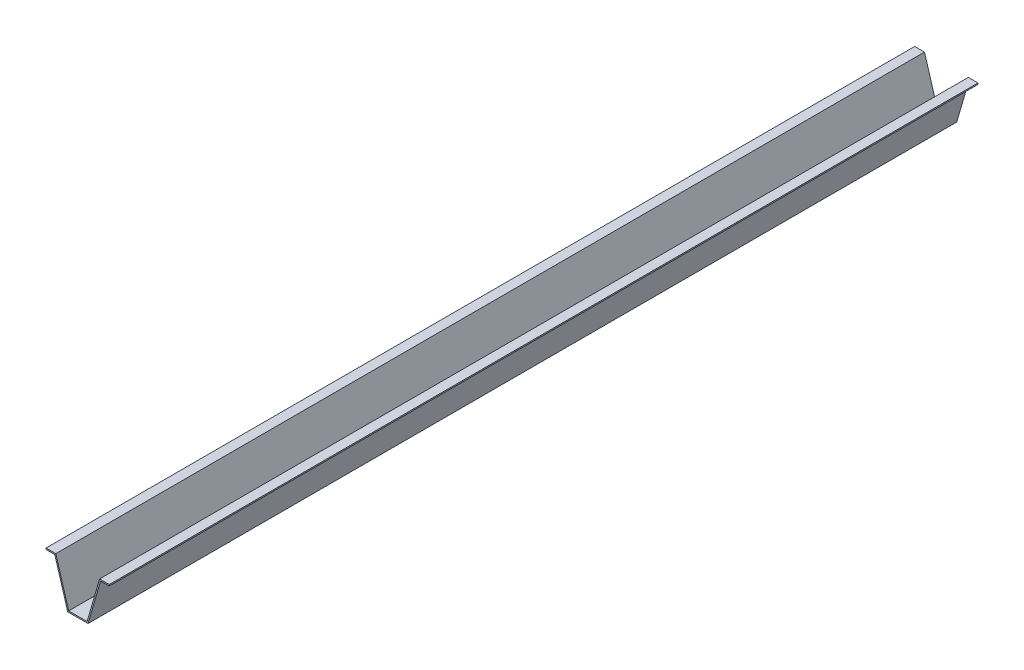
ISO-10303-21;
HEADER;
FILE_DESCRIPTION(('STEP AP214'),'2;1');
FILE_NAME('part.step','',(''),(''),'','','');
FILE_SCHEMA(('AUTOMOTIVE_DESIGN { 1 0 10303 214 1 1 1 1 }'));
ENDSEC;
DATA;
#1=APPLICATION_CONTEXT('core data for automotive mechanical design processes');
#2=APPLICATION_PROTOCOL_DEFINITION('international standard','automotive_design',2000,#1);
#3=PRODUCT_CONTEXT('',#1,'mechanical');
#4=PRODUCT('Part','Part','',(#3));
#5=PRODUCT_RELATED_PRODUCT_CATEGORY('part','',(#4));
#6=PRODUCT_DEFINITION_FORMATION('','',#4);
#7=PRODUCT_DEFINITION_CONTEXT('part definition',#1,'design');
#8=PRODUCT_DEFINITION('design','',#6,#7);
#9=PRODUCT_DEFINITION_SHAPE('','',#8);
#10=(LENGTH_UNIT() NAMED_UNIT(*) SI_UNIT(.MILLI.,.METRE.));
#11=(NAMED_UNIT(*) PLANE_ANGLE_UNIT() SI_UNIT($,.RADIAN.));
#12=(NAMED_UNIT(*) SI_UNIT($,.STERADIAN.) SOLID_ANGLE_UNIT());
#13=UNCERTAINTY_MEASURE_WITH_UNIT(LENGTH_MEASURE(1.E-05),#10,'distance_accuracy_value','');
#14=(GEOMETRIC_REPRESENTATION_CONTEXT(3) GLOBAL_UNCERTAINTY_ASSIGNED_CONTEXT((#13)) GLOBAL_UNIT_ASSIGNED_CONTEXT((#10,
#11,#12)) REPRESENTATION_CONTEXT('',''));
#15=CARTESIAN_POINT('',(0.,0.,0.));
#16=DIRECTION('',(0.,0.,1.));
#17=DIRECTION('',(1.,0.,0.));
#18=AXIS2_PLACEMENT_3D('',#15,#16,#17);
#19=CARTESIAN_POINT('',(53.2298011090364,23.227685088634,2000.));
#20=DIRECTION('',(0.,1.,0.));
#21=DIRECTION('',(0.,0.,1.));
#22=AXIS2_PLACEMENT_3D('',#19,#20,#21);
#23=PLANE('',#22);
#24=DIRECTION('',(1.,0.,0.));
#25=VECTOR('',#24,1.);
#26=CARTESIAN_POINT('',(53.2298011090364,23.227685088634,0.));
#27=LINE('',#26,#25);
#28=CARTESIAN_POINT('',(55.4828650000969,23.227685088634,0.));
#29=VERTEX_POINT('',#28);
#30=CARTESIAN_POINT('',(75.5177051757726,23.227685088634,0.));
#31=VERTEX_POINT('',#30);
#32=EDGE_CURVE('E155',#29,#31,#27,.T.);
#33=ORIENTED_EDGE('',*,*,#32,.T.);
#34=DIRECTION('',(0.,0.,-1.));
#35=VECTOR('',#34,1.);
#36=CARTESIAN_POINT('',(75.5177051757726,23.227685088634,2000.));
#37=LINE('',#36,#35);
#38=CARTESIAN_POINT('',(75.5177051757726,23.227685088634,2000.));
#39=VERTEX_POINT('',#38);
#40=EDGE_CURVE('E11',#39,#31,#37,.T.);
#41=ORIENTED_EDGE('',*,*,#40,.F.);
#42=DIRECTION('',(1.,0.,0.));
#43=VECTOR('',#42,1.);
#44=CARTESIAN_POINT('',(53.2298011090364,23.227685088634,2000.));
#45=LINE('',#44,#43);
#46=CARTESIAN_POINT('',(55.4828650000969,23.227685088634,2000.));
#47=VERTEX_POINT('',#46);
#48=EDGE_CURVE('E103',#47,#39,#45,.T.);
#49=ORIENTED_EDGE('',*,*,#48,.F.);
#50=DIRECTION('',(0.,0.,-1.));
#51=VECTOR('',#50,1.);
#52=CARTESIAN_POINT('',(55.4828650000969,23.227685088634,2000.));
#53=LINE('',#52,#51);
#54=EDGE_CURVE('E151',#47,#29,#53,.T.);
#55=ORIENTED_EDGE('',*,*,#54,.T.);
#56=EDGE_LOOP('',(#33,#41,#49,#55));
#57=FACE_BOUND('',#56,.T.);
#58=ADVANCED_FACE('F35',(#57),#23,.F.);
#59=CARTESIAN_POINT('',(75.5177051757726,26.227685088634,2000.));
#60=DIRECTION('',(1.,0.,0.));
#61=DIRECTION('',(0.,0.,-1.));
#62=AXIS2_PLACEMENT_3D('',#59,#60,#61);
#63=PLANE('',#62);
#64=DIRECTION('',(0.,-1.,0.));
#65=VECTOR('',#64,1.);
#66=CARTESIAN_POINT('',(75.5177051757726,26.227685088634,0.));
#67=LINE('',#66,#65);
#68=CARTESIAN_POINT('',(75.5177051757726,26.227685088634,0.));
#69=VERTEX_POINT('',#68);
#70=EDGE_CURVE('E158',#69,#31,#67,.T.);
#71=ORIENTED_EDGE('',*,*,#70,.F.);
#72=DIRECTION('',(0.,0.,-1.));
#73=VECTOR('',#72,1.);
#74=CARTESIAN_POINT('',(75.5177051757726,26.227685088634,2000.));
#75=LINE('',#74,#73);
#76=CARTESIAN_POINT('',(75.5177051757726,26.227685088634,2000.));
#77=VERTEX_POINT('',#76);
#78=EDGE_CURVE('E43',#77,#69,#75,.T.);
#79=ORIENTED_EDGE('',*,*,#78,.F.);
#80=DIRECTION('',(0.,-1.,0.));
#81=VECTOR('',#80,1.);
#82=CARTESIAN_POINT('',(75.5177051757726,26.227685088634,2000.));
#83=LINE('',#82,#81);
#84=EDGE_CURVE('E220',#77,#39,#83,.T.);
#85=ORIENTED_EDGE('',*,*,#84,.T.);
#86=ORIENTED_EDGE('',*,*,#40,.T.);
#87=EDGE_LOOP('',(#71,#79,#85,#86));
#88=FACE_BOUND('',#87,.T.);
#89=ADVANCED_FACE('F207',(#88),#63,.T.);
#90=CARTESIAN_POINT('',(53.2298011090364,26.227685088634,2000.));
#91=DIRECTION('',(0.,1.,0.));
#92=DIRECTION('',(0.,0.,1.));
#93=AXIS2_PLACEMENT_3D('',#90,#91,#92);
#94=PLANE('',#93);
#95=DIRECTION('',(1.,0.,0.));
#96=VECTOR('',#95,1.);
#97=CARTESIAN_POINT('',(53.2298011090364,26.227685088634,0.));
#98=LINE('',#97,#96);
#99=CARTESIAN_POINT('',(53.2298011090364,26.227685088634,0.));
#100=VERTEX_POINT('',#99);
#101=EDGE_CURVE('E161',#100,#69,#98,.T.);
#102=ORIENTED_EDGE('',*,*,#101,.F.);
#103=DIRECTION('',(0.,0.,-1.));
#104=VECTOR('',#103,1.);
#105=CARTESIAN_POINT('',(53.2298011090364,26.227685088634,2000.));
#106=LINE('',#105,#104);
#107=CARTESIAN_POINT('',(53.2298011090364,26.227685088634,2000.));
#108=VERTEX_POINT('',#107);
#109=EDGE_CURVE('E197',#108,#100,#106,.T.);
#110=ORIENTED_EDGE('',*,*,#109,.F.);
#111=DIRECTION('',(1.,0.,0.));
#112=VECTOR('',#111,1.);
#113=CARTESIAN_POINT('',(53.2298011090364,26.227685088634,2000.));
#114=LINE('',#113,#112);
#115=EDGE_CURVE('E204',#108,#77,#114,.T.);
#116=ORIENTED_EDGE('',*,*,#115,.T.);
#117=ORIENTED_EDGE('',*,*,#78,.T.);
#118=EDGE_LOOP('',(#102,#110,#116,#117));
#119=FACE_BOUND('',#118,.T.);
#120=ADVANCED_FACE('F202',(#119),#94,.T.);
#121=CARTESIAN_POINT('',(24.4131170631553,-73.0547966631908,2000.));
#122=DIRECTION('',(-0.960365033864225,0.278745406654469,0.));
#123=DIRECTION('',(-0.278745406654469,-0.960365033864225,0.));
#124=AXIS2_PLACEMENT_3D('',#121,#122,#123);
#125=PLANE('',#124);
#126=DIRECTION('',(0.278745406654469,0.960365033864225,0.));
#127=VECTOR('',#126,1.);
#128=CARTESIAN_POINT('',(24.4131170631553,-73.0547966631908,0.));
#129=LINE('',#128,#127);
#130=CARTESIAN_POINT('',(24.4131170631553,-73.0547966631908,0.));
#131=VERTEX_POINT('',#130);
#132=EDGE_CURVE('E164',#131,#100,#129,.T.);
#133=ORIENTED_EDGE('',*,*,#132,.F.);
#134=DIRECTION('',(0.,0.,-1.));
#135=VECTOR('',#134,1.);
#136=CARTESIAN_POINT('',(24.4131170631553,-73.0547966631908,2000.));
#137=LINE('',#136,#135);
#138=CARTESIAN_POINT('',(24.4131170631553,-73.0547966631908,2000.));
#139=VERTEX_POINT('',#138);
#140=EDGE_CURVE('E195',#139,#131,#137,.T.);
#141=ORIENTED_EDGE('',*,*,#140,.F.);
#142=DIRECTION('',(0.278745406654469,0.960365033864225,0.));
#143=VECTOR('',#142,1.);
#144=CARTESIAN_POINT('',(24.4131170631553,-73.0547966631908,2000.));
#145=LINE('',#144,#143);
#146=EDGE_CURVE('E217',#139,#108,#145,.T.);
#147=ORIENTED_EDGE('',*,*,#146,.T.);
#148=ORIENTED_EDGE('',*,*,#109,.T.);
#149=EDGE_LOOP('',(#133,#141,#147,#148));
#150=FACE_BOUND('',#149,.T.);
#151=ADVANCED_FACE('F214',(#150),#125,.T.);
#152=CARTESIAN_POINT('',(-17.9113876292326,-73.0547966631908,2000.));
#153=DIRECTION('',(0.,1.,0.));
#154=DIRECTION('',(0.,0.,1.));
#155=AXIS2_PLACEMENT_3D('',#152,#153,#154);
#156=PLANE('',#155);
#157=DIRECTION('',(1.,0.,0.));
#158=VECTOR('',#157,1.);
#159=CARTESIAN_POINT('',(-17.9113876292326,-73.0547966631908,0.));
#160=LINE('',#159,#158);
#161=CARTESIAN_POINT('',(-17.9113876292326,-73.0547966631908,0.));
#162=VERTEX_POINT('',#161);
#163=EDGE_CURVE('E167',#162,#131,#160,.T.);
#164=ORIENTED_EDGE('',*,*,#163,.F.);
#165=DIRECTION('',(0.,0.,-1.));
#166=VECTOR('',#165,1.);
#167=CARTESIAN_POINT('',(-17.9113876292326,-73.0547966631908,2000.));
#168=LINE('',#167,#166);
#169=CARTESIAN_POINT('',(-17.9113876292326,-73.0547966631908,2000.));
#170=VERTEX_POINT('',#169);
#171=EDGE_CURVE('E193',#170,#162,#168,.T.);
#172=ORIENTED_EDGE('',*,*,#171,.F.);
#173=DIRECTION('',(1.,0.,0.));
#174=VECTOR('',#173,1.);
#175=CARTESIAN_POINT('',(-17.9113876292326,-73.0547966631908,2000.));
#176=LINE('',#175,#174);
#177=EDGE_CURVE('E222',#170,#139,#176,.T.);
#178=ORIENTED_EDGE('',*,*,#177,.T.);
#179=ORIENTED_EDGE('',*,*,#140,.T.);
#180=EDGE_LOOP('',(#164,#172,#178,#179));
#181=FACE_BOUND('',#180,.T.);
#182=ADVANCED_FACE('F322',(#181),#156,.T.);
#183=CARTESIAN_POINT('',(-47.6285930515475,26.227685088634,2000.));
#184=DIRECTION('',(0.958005466795834,0.286749935639569,0.));
#185=DIRECTION('',(-0.286749935639569,0.958005466795834,0.));
#186=AXIS2_PLACEMENT_3D('',#183,#184,#185);
#187=PLANE('',#186);
#188=DIRECTION('',(0.286749935639569,-0.958005466795834,0.));
#189=VECTOR('',#188,1.);
#190=CARTESIAN_POINT('',(-47.6285930515475,26.227685088634,0.));
#191=LINE('',#190,#189);
#192=CARTESIAN_POINT('',(-47.6285930515475,26.227685088634,0.));
#193=VERTEX_POINT('',#192);
#194=EDGE_CURVE('E170',#193,#162,#191,.T.);
#195=ORIENTED_EDGE('',*,*,#194,.F.);
#196=DIRECTION('',(0.,0.,-1.));
#197=VECTOR('',#196,1.);
#198=CARTESIAN_POINT('',(-47.6285930515475,26.227685088634,2000.));
#199=LINE('',#198,#197);
#200=CARTESIAN_POINT('',(-47.6285930515475,26.227685088634,2000.));
#201=VERTEX_POINT('',#200);
#202=EDGE_CURVE('E191',#201,#193,#199,.T.);
#203=ORIENTED_EDGE('',*,*,#202,.F.);
#204=DIRECTION('',(0.286749935639569,-0.958005466795834,0.));
#205=VECTOR('',#204,1.);
#206=CARTESIAN_POINT('',(-47.6285930515475,26.227685088634,2000.));
#207=LINE('',#206,#205);
#208=EDGE_CURVE('E228',#201,#170,#207,.T.);
#209=ORIENTED_EDGE('',*,*,#208,.T.);
#210=ORIENTED_EDGE('',*,*,#171,.T.);
#211=EDGE_LOOP('',(#195,#203,#209,#210));
#212=FACE_BOUND('',#211,.T.);
#213=ADVANCED_FACE('F313',(#212),#187,.T.);
#214=CARTESIAN_POINT('',(-70.1416274623922,26.227685088634,2000.));
#215=DIRECTION('',(0.,1.,0.));
#216=DIRECTION('',(0.,0.,1.));
#217=AXIS2_PLACEMENT_3D('',#214,#215,#216);
#218=PLANE('',#217);
#219=DIRECTION('',(1.,0.,0.));
#220=VECTOR('',#219,1.);
#221=CARTESIAN_POINT('',(-70.1416274623922,26.227685088634,0.));
#222=LINE('',#221,#220);
#223=CARTESIAN_POINT('',(-70.1416274623922,26.227685088634,0.));
#224=VERTEX_POINT('',#223);
#225=EDGE_CURVE('E173',#224,#193,#222,.T.);
#226=ORIENTED_EDGE('',*,*,#225,.F.);
#227=DIRECTION('',(0.,0.,-1.));
#228=VECTOR('',#227,1.);
#229=CARTESIAN_POINT('',(-70.1416274623922,26.227685088634,2000.));
#230=LINE('',#229,#228);
#231=CARTESIAN_POINT('',(-70.1416274623922,26.227685088634,2000.));
#232=VERTEX_POINT('',#231);
#233=EDGE_CURVE('E189',#232,#224,#230,.T.);
#234=ORIENTED_EDGE('',*,*,#233,.F.);
#235=DIRECTION('',(1.,0.,0.));
#236=VECTOR('',#235,1.);
#237=CARTESIAN_POINT('',(-70.1416274623922,26.227685088634,2000.));
#238=LINE('',#237,#236);
#239=EDGE_CURVE('E231',#232,#201,#238,.T.);
#240=ORIENTED_EDGE('',*,*,#239,.T.);
#241=ORIENTED_EDGE('',*,*,#202,.T.);
#242=EDGE_LOOP('',(#226,#234,#240,#241));
#243=FACE_BOUND('',#242,.T.);
#244=ADVANCED_FACE('F243',(#243),#218,.T.);
#245=CARTESIAN_POINT('',(-70.1416274623922,23.227685088634,2000.));
#246=DIRECTION('',(-1.,0.,0.));
#247=DIRECTION('',(0.,0.,1.));
#248=AXIS2_PLACEMENT_3D('',#245,#246,#247);
#249=PLANE('',#248);
#250=DIRECTION('',(0.,1.,0.));
#251=VECTOR('',#250,1.);
#252=CARTESIAN_POINT('',(-70.1416274623922,23.227685088634,0.));
#253=LINE('',#252,#251);
#254=CARTESIAN_POINT('',(-70.1416274623922,23.227685088634,0.));
#255=VERTEX_POINT('',#254);
#256=EDGE_CURVE('E176',#255,#224,#253,.T.);
#257=ORIENTED_EDGE('',*,*,#256,.F.);
#258=DIRECTION('',(0.,0.,-1.));
#259=VECTOR('',#258,1.);
#260=CARTESIAN_POINT('',(-70.1416274623922,23.227685088634,2000.));
#261=LINE('',#260,#259);
#262=CARTESIAN_POINT('',(-70.1416274623922,23.227685088634,2000.));
#263=VERTEX_POINT('',#262);
#264=EDGE_CURVE('E187',#263,#255,#261,.T.);
#265=ORIENTED_EDGE('',*,*,#264,.F.);
#266=DIRECTION('',(0.,1.,0.));
#267=VECTOR('',#266,1.);
#268=CARTESIAN_POINT('',(-70.1416274623922,23.227685088634,2000.));
#269=LINE('',#268,#267);
#270=EDGE_CURVE('E234',#263,#232,#269,.T.);
#271=ORIENTED_EDGE('',*,*,#270,.T.);
#272=ORIENTED_EDGE('',*,*,#233,.T.);
#273=EDGE_LOOP('',(#257,#265,#271,#272));
#274=FACE_BOUND('',#273,.T.);
#275=ADVANCED_FACE('F238',(#274),#249,.T.);
#276=CARTESIAN_POINT('',(-70.1416274623922,23.227685088634,2000.));
#277=DIRECTION('',(0.,1.,0.));
#278=DIRECTION('',(0.,0.,1.));
#279=AXIS2_PLACEMENT_3D('',#276,#277,#278);
#280=PLANE('',#279);
#281=DIRECTION('',(1.,0.,0.));
#282=VECTOR('',#281,1.);
#283=CARTESIAN_POINT('',(-70.1416274623922,23.227685088634,0.));
#284=LINE('',#283,#282);
#285=CARTESIAN_POINT('',(-49.8621400063869,23.227685088634,0.));
#286=VERTEX_POINT('',#285);
#287=EDGE_CURVE('E179',#255,#286,#284,.T.);
#288=ORIENTED_EDGE('',*,*,#287,.T.);
#289=DIRECTION('',(0.,0.,-1.));
#290=VECTOR('',#289,1.);
#291=CARTESIAN_POINT('',(-49.8621400063869,23.227685088634,2000.));
#292=LINE('',#291,#290);
#293=CARTESIAN_POINT('',(-49.8621400063869,23.227685088634,2000.));
#294=VERTEX_POINT('',#293);
#295=EDGE_CURVE('E146',#294,#286,#292,.T.);
#296=ORIENTED_EDGE('',*,*,#295,.F.);
#297=DIRECTION('',(1.,0.,0.));
#298=VECTOR('',#297,1.);
#299=CARTESIAN_POINT('',(-70.1416274623922,23.227685088634,2000.));
#300=LINE('',#299,#298);
#301=EDGE_CURVE('E137',#263,#294,#300,.T.);
#302=ORIENTED_EDGE('',*,*,#301,.F.);
#303=ORIENTED_EDGE('',*,*,#264,.T.);
#304=EDGE_LOOP('',(#288,#296,#302,#303));
#305=FACE_BOUND('',#304,.T.);
#306=ADVANCED_FACE('F247',(#305),#280,.F.);
#307=CARTESIAN_POINT('',(-50.502609451935,25.3674352817153,2000.));
#308=DIRECTION('',(0.958005466795833,0.286749935639569,0.));
#309=DIRECTION('',(-0.286749935639569,0.958005466795834,0.));
#310=AXIS2_PLACEMENT_3D('',#307,#308,#309);
#311=PLANE('',#310);
#312=DIRECTION('',(0.286749935639569,-0.958005466795834,0.));
#313=VECTOR('',#312,1.);
#314=CARTESIAN_POINT('',(-50.502609451935,25.3674352817153,0.));
#315=LINE('',#314,#313);
#316=CARTESIAN_POINT('',(-20.144934584072,-76.0547966631908,0.));
#317=VERTEX_POINT('',#316);
#318=EDGE_CURVE('E145',#286,#317,#315,.T.);
#319=ORIENTED_EDGE('',*,*,#318,.T.);
#320=DIRECTION('',(0.,0.,-1.));
#321=VECTOR('',#320,1.);
#322=CARTESIAN_POINT('',(-20.144934584072,-76.0547966631908,2000.));
#323=LINE('',#322,#321);
#324=CARTESIAN_POINT('',(-20.144934584072,-76.0547966631908,2000.));
#325=VERTEX_POINT('',#324);
#326=EDGE_CURVE('E142',#325,#317,#323,.T.);
#327=ORIENTED_EDGE('',*,*,#326,.F.);
#328=DIRECTION('',(0.286749935639569,-0.958005466795834,0.));
#329=VECTOR('',#328,1.);
#330=CARTESIAN_POINT('',(-50.502609451935,25.3674352817153,2000.));
#331=LINE('',#330,#329);
#332=EDGE_CURVE('E130',#294,#325,#331,.T.);
#333=ORIENTED_EDGE('',*,*,#332,.F.);
#334=ORIENTED_EDGE('',*,*,#295,.T.);
#335=EDGE_LOOP('',(#319,#327,#333,#334));
#336=FACE_BOUND('',#335,.T.);
#337=ADVANCED_FACE('F143',(#336),#311,.F.);
#338=CARTESIAN_POINT('',(-17.9113876292326,-76.0547966631908,2000.));
#339=DIRECTION('',(0.,1.,0.));
#340=DIRECTION('',(0.,0.,1.));
#341=AXIS2_PLACEMENT_3D('',#338,#339,#340);
#342=PLANE('',#341);
#343=DIRECTION('',(1.,0.,0.));
#344=VECTOR('',#343,1.);
#345=CARTESIAN_POINT('',(-17.9113876292326,-76.0547966631908,0.));
#346=LINE('',#345,#344);
#347=CARTESIAN_POINT('',(26.6661809542158,-76.0547966631908,0.));
#348=VERTEX_POINT('',#347);
#349=EDGE_CURVE('E91',#317,#348,#346,.T.);
#350=ORIENTED_EDGE('',*,*,#349,.T.);
#351=DIRECTION('',(0.,0.,-1.));
#352=VECTOR('',#351,1.);
#353=CARTESIAN_POINT('',(26.6661809542158,-76.0547966631908,2000.));
#354=LINE('',#353,#352);
#355=CARTESIAN_POINT('',(26.6661809542158,-76.0547966631908,2000.));
#356=VERTEX_POINT('',#355);
#357=EDGE_CURVE('E147',#356,#348,#354,.T.);
#358=ORIENTED_EDGE('',*,*,#357,.F.);
#359=DIRECTION('',(1.,0.,0.));
#360=VECTOR('',#359,1.);
#361=CARTESIAN_POINT('',(-17.9113876292326,-76.0547966631908,2000.));
#362=LINE('',#361,#360);
#363=EDGE_CURVE('E134',#325,#356,#362,.T.);
#364=ORIENTED_EDGE('',*,*,#363,.F.);
#365=ORIENTED_EDGE('',*,*,#326,.T.);
#366=EDGE_LOOP('',(#350,#358,#364,#365));
#367=FACE_BOUND('',#366,.T.);
#368=ADVANCED_FACE('F149',(#367),#342,.F.);
#369=CARTESIAN_POINT('',(27.294212164748,-73.8910328831542,2000.));
#370=DIRECTION('',(-0.960365033864225,0.278745406654469,0.));
#371=DIRECTION('',(-0.278745406654469,-0.960365033864225,0.));
#372=AXIS2_PLACEMENT_3D('',#369,#370,#371);
#373=PLANE('',#372);
#374=DIRECTION('',(0.278745406654469,0.960365033864225,0.));
#375=VECTOR('',#374,1.);
#376=CARTESIAN_POINT('',(27.294212164748,-73.8910328831542,0.));
#377=LINE('',#376,#375);
#378=EDGE_CURVE('E97',#348,#29,#377,.T.);
#379=ORIENTED_EDGE('',*,*,#378,.T.);
#380=ORIENTED_EDGE('',*,*,#54,.F.);
#381=DIRECTION('',(0.278745406654469,0.960365033864225,0.));
#382=VECTOR('',#381,1.);
#383=CARTESIAN_POINT('',(27.294212164748,-73.8910328831542,2000.));
#384=LINE('',#383,#382);
#385=EDGE_CURVE('E51',#356,#47,#384,.T.);
#386=ORIENTED_EDGE('',*,*,#385,.F.);
#387=ORIENTED_EDGE('',*,*,#357,.T.);
#388=EDGE_LOOP('',(#379,#380,#386,#387));
#389=FACE_BOUND('',#388,.T.);
#390=ADVANCED_FACE('F261',(#389),#373,.F.);
#391=CARTESIAN_POINT('',(0.,0.,2000.));
#392=DIRECTION('',(0.,0.,-1.));
#393=DIRECTION('',(-1.,0.,0.));
#394=AXIS2_PLACEMENT_3D('',#391,#392,#393);
#395=PLANE('',#394);
#396=ORIENTED_EDGE('',*,*,#48,.T.);
#397=ORIENTED_EDGE('',*,*,#84,.F.);
#398=ORIENTED_EDGE('',*,*,#115,.F.);
#399=ORIENTED_EDGE('',*,*,#146,.F.);
#400=ORIENTED_EDGE('',*,*,#177,.F.);
#401=ORIENTED_EDGE('',*,*,#208,.F.);
#402=ORIENTED_EDGE('',*,*,#239,.F.);
#403=ORIENTED_EDGE('',*,*,#270,.F.);
#404=ORIENTED_EDGE('',*,*,#301,.T.);
#405=ORIENTED_EDGE('',*,*,#332,.T.);
#406=ORIENTED_EDGE('',*,*,#363,.T.);
#407=ORIENTED_EDGE('',*,*,#385,.T.);
#408=EDGE_LOOP('',(#396,#397,#398,#399,#400,#401,#402,#403,#404,#405,#406,#407));
#409=FACE_BOUND('',#408,.T.);
#410=ADVANCED_FACE('F132',(#409),#395,.F.);
#411=CARTESIAN_POINT('',(0.,0.,0.));
#412=DIRECTION('',(0.,0.,-1.));
#413=DIRECTION('',(-1.,0.,0.));
#414=AXIS2_PLACEMENT_3D('',#411,#412,#413);
#415=PLANE('',#414);
#416=ORIENTED_EDGE('',*,*,#32,.F.);
#417=ORIENTED_EDGE('',*,*,#378,.F.);
#418=ORIENTED_EDGE('',*,*,#349,.F.);
#419=ORIENTED_EDGE('',*,*,#318,.F.);
#420=ORIENTED_EDGE('',*,*,#287,.F.);
#421=ORIENTED_EDGE('',*,*,#256,.T.);
#422=ORIENTED_EDGE('',*,*,#225,.T.);
#423=ORIENTED_EDGE('',*,*,#194,.T.);
#424=ORIENTED_EDGE('',*,*,#163,.T.);
#425=ORIENTED_EDGE('',*,*,#132,.T.);
#426=ORIENTED_EDGE('',*,*,#101,.T.);
#427=ORIENTED_EDGE('',*,*,#70,.T.);
#428=EDGE_LOOP('',(#416,#417,#418,#419,#420,#421,#422,#423,#424,#425,#426,#427));
#429=FACE_BOUND('',#428,.T.);
#430=ADVANCED_FACE('F210',(#429),#415,.T.);
#431=CLOSED_SHELL('',(#58,#89,#120,#151,#182,#213,#244,#275,#306,#337,#368,#390,#410,#430));
#432=MANIFOLD_SOLID_BREP('B2',#431);
#433=ADVANCED_BREP_SHAPE_REPRESENTATION('',(#18,#432),#14);
#434=SHAPE_DEFINITION_REPRESENTATION(#9,#433);
ENDSEC;
END-ISO-10303-21;
